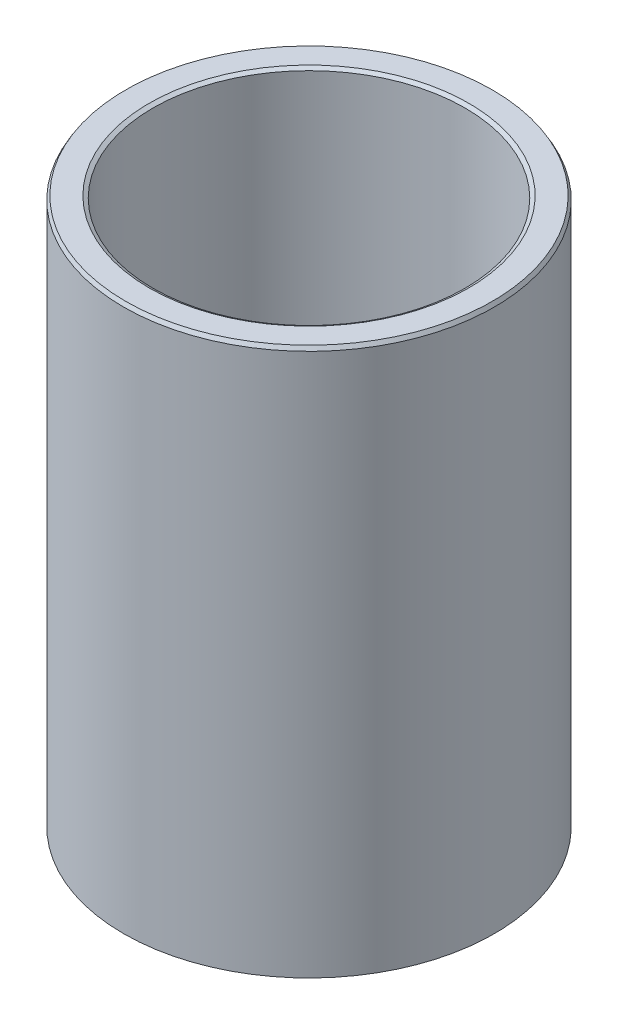
ISO-10303-21;
HEADER;
FILE_DESCRIPTION(('STEP AP214'),'2;1');
FILE_NAME('part.step','',(''),(''),'','','');
FILE_SCHEMA(('AUTOMOTIVE_DESIGN { 1 0 10303 214 1 1 1 1 }'));
ENDSEC;
DATA;
#1=APPLICATION_CONTEXT('core data for automotive mechanical design processes');
#2=APPLICATION_PROTOCOL_DEFINITION('international standard','automotive_design',2000,#1);
#3=PRODUCT_CONTEXT('',#1,'mechanical');
#4=PRODUCT('Part','Part','',(#3));
#5=PRODUCT_RELATED_PRODUCT_CATEGORY('part','',(#4));
#6=PRODUCT_DEFINITION_FORMATION('','',#4);
#7=PRODUCT_DEFINITION_CONTEXT('part definition',#1,'design');
#8=PRODUCT_DEFINITION('design','',#6,#7);
#9=PRODUCT_DEFINITION_SHAPE('','',#8);
#10=(LENGTH_UNIT() NAMED_UNIT(*) SI_UNIT(.MILLI.,.METRE.));
#11=(NAMED_UNIT(*) PLANE_ANGLE_UNIT() SI_UNIT($,.RADIAN.));
#12=(NAMED_UNIT(*) SI_UNIT($,.STERADIAN.) SOLID_ANGLE_UNIT());
#13=UNCERTAINTY_MEASURE_WITH_UNIT(LENGTH_MEASURE(1.E-05),#10,'distance_accuracy_value','');
#14=(GEOMETRIC_REPRESENTATION_CONTEXT(3) GLOBAL_UNCERTAINTY_ASSIGNED_CONTEXT((#13)) GLOBAL_UNIT_ASSIGNED_CONTEXT((#10,
#11,#12)) REPRESENTATION_CONTEXT('',''));
#15=CARTESIAN_POINT('',(0.,0.,0.));
#16=DIRECTION('',(0.,0.,1.));
#17=DIRECTION('',(1.,0.,0.));
#18=AXIS2_PLACEMENT_3D('',#15,#16,#17);
#19=CARTESIAN_POINT('',(0.,110.953792737399,0.));
#20=DIRECTION('',(0.,-1.,0.));
#21=DIRECTION('',(0.,0.,-1.));
#22=AXIS2_PLACEMENT_3D('',#19,#20,#21);
#23=CYLINDRICAL_SURFACE('',#22,37.5);
#24=CARTESIAN_POINT('',(0.,0.44217612284092,0.));
#25=DIRECTION('',(0.,1.,0.));
#26=DIRECTION('',(0.,0.,1.));
#27=AXIS2_PLACEMENT_3D('',#24,#25,#26);
#28=CIRCLE('',#27,37.5);
#29=CARTESIAN_POINT('',(0.,0.44217612284092,37.5));
#30=VERTEX_POINT('',#29);
#31=EDGE_CURVE('E10',#30,#30,#28,.T.);
#32=ORIENTED_EDGE('',*,*,#31,.T.);
#33=EDGE_LOOP('',(#32));
#34=FACE_BOUND('',#33,.T.);
#35=CARTESIAN_POINT('',(0.,110.187921226745,0.));
#36=DIRECTION('',(0.,1.,0.));
#37=DIRECTION('',(0.,0.,1.));
#38=AXIS2_PLACEMENT_3D('',#35,#36,#37);
#39=CIRCLE('',#38,37.5);
#40=CARTESIAN_POINT('',(0.,110.187921226745,37.5));
#41=VERTEX_POINT('',#40);
#42=EDGE_CURVE('E50',#41,#41,#39,.F.);
#43=ORIENTED_EDGE('',*,*,#42,.T.);
#44=EDGE_LOOP('',(#43));
#45=FACE_BOUND('',#44,.T.);
#46=ADVANCED_FACE('F39',(#34,#45),#23,.T.);
#47=CARTESIAN_POINT('',(0.,110.953792737399,0.));
#48=DIRECTION('',(0.,1.,0.));
#49=DIRECTION('',(0.,0.,1.));
#50=AXIS2_PLACEMENT_3D('',#47,#48,#49);
#51=PLANE('',#50);
#52=CARTESIAN_POINT('',(0.,110.953792737399,0.));
#53=DIRECTION('',(0.,1.,0.));
#54=DIRECTION('',(0.,0.,1.));
#55=AXIS2_PLACEMENT_3D('',#52,#53,#54);
#56=CIRCLE('',#55,32.3360242630203);
#57=CARTESIAN_POINT('',(0.,110.953792737399,32.3360242630203));
#58=VERTEX_POINT('',#57);
#59=EDGE_CURVE('E58',#58,#58,#56,.F.);
#60=ORIENTED_EDGE('',*,*,#59,.T.);
#61=EDGE_LOOP('',(#60));
#62=FACE_BOUND('',#61,.T.);
#63=CARTESIAN_POINT('',(0.,110.953792737399,0.));
#64=DIRECTION('',(0.,1.,0.));
#65=DIRECTION('',(0.,0.,1.));
#66=AXIS2_PLACEMENT_3D('',#63,#64,#65);
#67=CIRCLE('',#66,37.0578238771591);
#68=CARTESIAN_POINT('',(0.,110.953792737399,37.0578238771591));
#69=VERTEX_POINT('',#68);
#70=EDGE_CURVE('E61',#69,#69,#67,.T.);
#71=ORIENTED_EDGE('',*,*,#70,.T.);
#72=EDGE_LOOP('',(#71));
#73=FACE_BOUND('',#72,.T.);
#74=ADVANCED_FACE('F88',(#62,#73),#51,.T.);
#75=CARTESIAN_POINT('',(0.,0.,0.));
#76=DIRECTION('',(0.,1.,0.));
#77=DIRECTION('',(0.,0.,1.));
#78=AXIS2_PLACEMENT_3D('',#75,#76,#77);
#79=PLANE('',#78);
#80=CARTESIAN_POINT('',(0.,0.,0.));
#81=DIRECTION('',(0.,1.,0.));
#82=DIRECTION('',(0.,0.,1.));
#83=AXIS2_PLACEMENT_3D('',#80,#81,#82);
#84=CIRCLE('',#83,32.0123288752069);
#85=CARTESIAN_POINT('',(0.,0.,32.0123288752069));
#86=VERTEX_POINT('',#85);
#87=EDGE_CURVE('E51',#86,#86,#84,.T.);
#88=ORIENTED_EDGE('',*,*,#87,.T.);
#89=EDGE_LOOP('',(#88));
#90=FACE_BOUND('',#89,.T.);
#91=CARTESIAN_POINT('',(0.,0.,0.));
#92=DIRECTION('',(0.,1.,0.));
#93=DIRECTION('',(0.,0.,1.));
#94=AXIS2_PLACEMENT_3D('',#91,#92,#93);
#95=CIRCLE('',#94,36.7341284893457);
#96=CARTESIAN_POINT('',(0.,0.,36.7341284893457));
#97=VERTEX_POINT('',#96);
#98=EDGE_CURVE('E54',#97,#97,#95,.F.);
#99=ORIENTED_EDGE('',*,*,#98,.T.);
#100=EDGE_LOOP('',(#99));
#101=FACE_BOUND('',#100,.T.);
#102=ADVANCED_FACE('F83',(#90,#101),#79,.F.);
#103=CARTESIAN_POINT('',(0.,110.953792737399,0.));
#104=DIRECTION('',(0.,-1.,0.));
#105=DIRECTION('',(0.,0.,-1.));
#106=AXIS2_PLACEMENT_3D('',#103,#104,#105);
#107=CYLINDRICAL_SURFACE('',#106,31.570152752366);
#108=CARTESIAN_POINT('',(0.,110.511616614558,0.));
#109=DIRECTION('',(0.,1.,0.));
#110=DIRECTION('',(0.,0.,1.));
#111=AXIS2_PLACEMENT_3D('',#108,#109,#110);
#112=CIRCLE('',#111,31.570152752366);
#113=CARTESIAN_POINT('',(0.,110.511616614558,31.570152752366));
#114=VERTEX_POINT('',#113);
#115=EDGE_CURVE('E67',#114,#114,#112,.T.);
#116=ORIENTED_EDGE('',*,*,#115,.T.);
#117=EDGE_LOOP('',(#116));
#118=FACE_BOUND('',#117,.T.);
#119=CARTESIAN_POINT('',(0.,0.765871510654298,0.));
#120=DIRECTION('',(0.,1.,0.));
#121=DIRECTION('',(0.,0.,1.));
#122=AXIS2_PLACEMENT_3D('',#119,#120,#121);
#123=CIRCLE('',#122,31.570152752366);
#124=CARTESIAN_POINT('',(0.,0.765871510654298,31.570152752366));
#125=VERTEX_POINT('',#124);
#126=EDGE_CURVE('E69',#125,#125,#123,.F.);
#127=ORIENTED_EDGE('',*,*,#126,.T.);
#128=EDGE_LOOP('',(#127));
#129=FACE_BOUND('',#128,.T.);
#130=ADVANCED_FACE('F71',(#118,#129),#107,.F.);
#131=CARTESIAN_POINT('',(0.,110.511616614558,0.));
#132=DIRECTION('',(0.,1.,0.));
#133=DIRECTION('',(0.,0.,1.));
#134=AXIS2_PLACEMENT_3D('',#131,#132,#133);
#135=CONICAL_SURFACE('',#134,31.570152752366,1.0471975511966);
#136=ORIENTED_EDGE('',*,*,#59,.F.);
#137=EDGE_LOOP('',(#136));
#138=FACE_BOUND('',#137,.T.);
#139=ORIENTED_EDGE('',*,*,#115,.F.);
#140=EDGE_LOOP('',(#139));
#141=FACE_BOUND('',#140,.T.);
#142=ADVANCED_FACE('F77',(#138,#141),#135,.F.);
#143=CARTESIAN_POINT('',(0.,0.,0.));
#144=DIRECTION('',(0.,-1.,0.));
#145=DIRECTION('',(0.,0.,-1.));
#146=AXIS2_PLACEMENT_3D('',#143,#144,#145);
#147=CONICAL_SURFACE('',#146,32.0123288752069,0.523598775598309);
#148=ORIENTED_EDGE('',*,*,#126,.F.);
#149=EDGE_LOOP('',(#148));
#150=FACE_BOUND('',#149,.T.);
#151=ORIENTED_EDGE('',*,*,#87,.F.);
#152=EDGE_LOOP('',(#151));
#153=FACE_BOUND('',#152,.T.);
#154=ADVANCED_FACE('F73',(#150,#153),#147,.F.);
#155=CARTESIAN_POINT('',(0.,0.44217612284092,0.));
#156=DIRECTION('',(0.,1.,0.));
#157=DIRECTION('',(0.,0.,1.));
#158=AXIS2_PLACEMENT_3D('',#155,#156,#157);
#159=CONICAL_SURFACE('',#158,37.5,1.04719755119659);
#160=ORIENTED_EDGE('',*,*,#98,.F.);
#161=EDGE_LOOP('',(#160));
#162=FACE_BOUND('',#161,.T.);
#163=ORIENTED_EDGE('',*,*,#31,.F.);
#164=EDGE_LOOP('',(#163));
#165=FACE_BOUND('',#164,.T.);
#166=ADVANCED_FACE('F76',(#162,#165),#159,.T.);
#167=CARTESIAN_POINT('',(0.,110.953792737399,0.));
#168=DIRECTION('',(0.,-1.,0.));
#169=DIRECTION('',(0.,0.,-1.));
#170=AXIS2_PLACEMENT_3D('',#167,#168,#169);
#171=CONICAL_SURFACE('',#170,37.0578238771591,0.523598775598289);
#172=ORIENTED_EDGE('',*,*,#42,.F.);
#173=EDGE_LOOP('',(#172));
#174=FACE_BOUND('',#173,.T.);
#175=ORIENTED_EDGE('',*,*,#70,.F.);
#176=EDGE_LOOP('',(#175));
#177=FACE_BOUND('',#176,.T.);
#178=ADVANCED_FACE('F45',(#174,#177),#171,.T.);
#179=CLOSED_SHELL('',(#46,#74,#102,#130,#142,#154,#166,#178));
#180=MANIFOLD_SOLID_BREP('B2',#179);
#181=ADVANCED_BREP_SHAPE_REPRESENTATION('',(#18,#180),#14);
#182=SHAPE_DEFINITION_REPRESENTATION(#9,#181);
ENDSEC;
END-ISO-10303-21;
